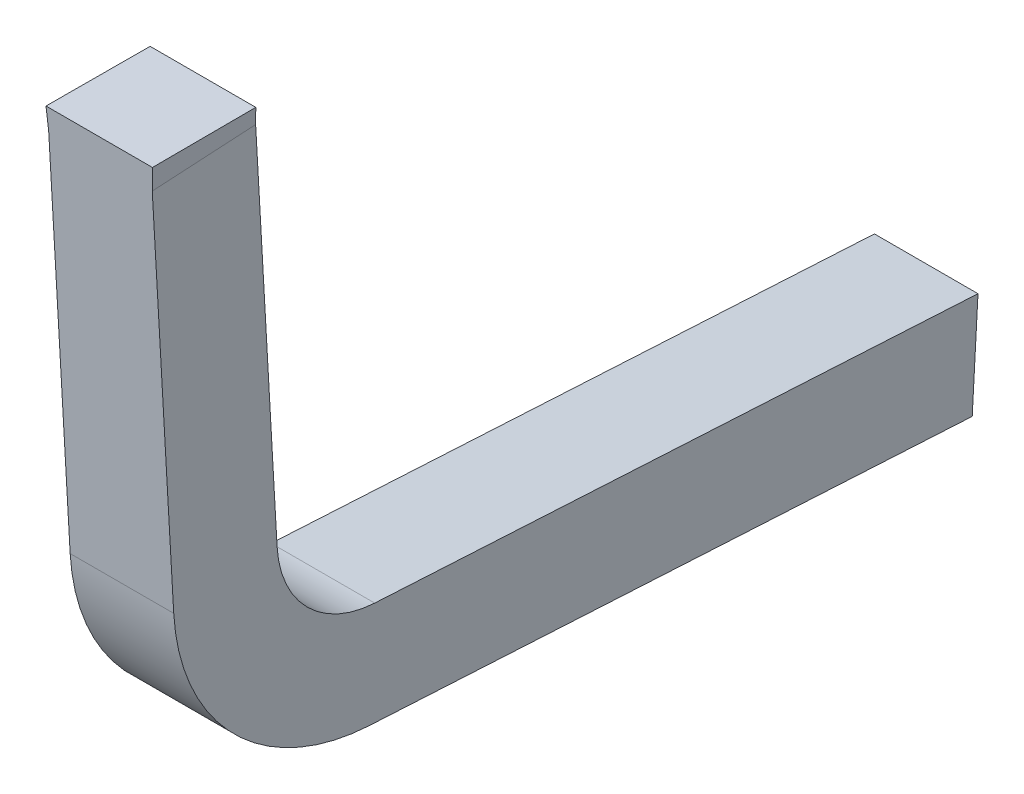
ISO-10303-21;
HEADER;
FILE_DESCRIPTION(('STEP AP214'),'2;1');
FILE_NAME('part.step','',(''),(''),'','','');
FILE_SCHEMA(('AUTOMOTIVE_DESIGN { 1 0 10303 214 1 1 1 1 }'));
ENDSEC;
DATA;
#1=APPLICATION_CONTEXT('core data for automotive mechanical design processes');
#2=APPLICATION_PROTOCOL_DEFINITION('international standard','automotive_design',2000,#1);
#3=PRODUCT_CONTEXT('',#1,'mechanical');
#4=PRODUCT('Part','Part','',(#3));
#5=PRODUCT_RELATED_PRODUCT_CATEGORY('part','',(#4));
#6=PRODUCT_DEFINITION_FORMATION('','',#4);
#7=PRODUCT_DEFINITION_CONTEXT('part definition',#1,'design');
#8=PRODUCT_DEFINITION('design','',#6,#7);
#9=PRODUCT_DEFINITION_SHAPE('','',#8);
#10=(LENGTH_UNIT() NAMED_UNIT(*) SI_UNIT(.MILLI.,.METRE.));
#11=(NAMED_UNIT(*) PLANE_ANGLE_UNIT() SI_UNIT($,.RADIAN.));
#12=(NAMED_UNIT(*) SI_UNIT($,.STERADIAN.) SOLID_ANGLE_UNIT());
#13=UNCERTAINTY_MEASURE_WITH_UNIT(LENGTH_MEASURE(1.E-05),#10,'distance_accuracy_value','');
#14=(GEOMETRIC_REPRESENTATION_CONTEXT(3) GLOBAL_UNCERTAINTY_ASSIGNED_CONTEXT((#13)) GLOBAL_UNIT_ASSIGNED_CONTEXT((#10,
#11,#12)) REPRESENTATION_CONTEXT('',''));
#15=CARTESIAN_POINT('',(0.,0.,0.));
#16=DIRECTION('',(0.,0.,1.));
#17=DIRECTION('',(1.,0.,0.));
#18=AXIS2_PLACEMENT_3D('',#15,#16,#17);
#19=CARTESIAN_POINT('',(3.398593165818,-2.29897527843,-10.34781984343));
#20=DIRECTION('',(0.997785157857701,0.0664110878974701,0.003787632922693));
#21=DIRECTION('',(-0.0664115642747469,0.997792315129046,0.));
#22=AXIS2_PLACEMENT_3D('',#19,#20,#21);
#23=PLANE('',#22);
#24=DIRECTION('',(0.,-0.0569406083110753,0.998377567418842));
#25=VECTOR('',#24,1.);
#26=CARTESIAN_POINT('',(3.4,-2.314349492935,-10.44885919008));
#27=LINE('',#26,#25);
#28=CARTESIAN_POINT('',(3.4,-2.31434949293492,-10.4488591900814));
#29=VERTEX_POINT('',#28);
#30=CARTESIAN_POINT('',(3.4,-2.32573761459728,-10.2491836765951));
#31=VERTEX_POINT('',#30);
#32=EDGE_CURVE('E98',#29,#31,#27,.T.);
#33=ORIENTED_EDGE('',*,*,#32,.T.);
#34=DIRECTION('',(0.0665190105147783,-0.996166318707982,-0.056814493854309));
#35=VECTOR('',#34,1.);
#36=CARTESIAN_POINT('',(3.397186331635,-2.28360106392498,-10.2467804967704));
#37=LINE('',#36,#35);
#38=CARTESIAN_POINT('',(3.397186331635,-2.28360106392499,-10.2467804967704));
#39=VERTEX_POINT('',#38);
#40=EDGE_CURVE('E148',#39,#31,#37,.T.);
#41=ORIENTED_EDGE('',*,*,#40,.F.);
#42=DIRECTION('',(-0.00379601320157547,0.,0.999992795115932));
#43=VECTOR('',#42,1.);
#44=CARTESIAN_POINT('',(3.397946773511,-2.283601063925,-10.4471055106));
#45=LINE('',#44,#43);
#46=CARTESIAN_POINT('',(3.397946773511,-2.28360106392489,-10.4471055106019));
#47=VERTEX_POINT('',#46);
#48=EDGE_CURVE('E161',#47,#39,#45,.T.);
#49=ORIENTED_EDGE('',*,*,#48,.F.);
#50=DIRECTION('',(0.0665190105273673,-0.996166318707226,-0.0568144938528306));
#51=VECTOR('',#50,1.);
#52=CARTESIAN_POINT('',(3.397946773511,-2.28360106392483,-10.4471055106029));
#53=LINE('',#52,#51);
#54=EDGE_CURVE('E103',#47,#29,#53,.T.);
#55=ORIENTED_EDGE('',*,*,#54,.T.);
#56=EDGE_LOOP('',(#33,#41,#49,#55));
#57=FACE_BOUND('',#56,.T.);
#58=ADVANCED_FACE('F17',(#57),#23,.F.);
#59=CARTESIAN_POINT('',(3.5,-2.283601063925,-10.34694300369));
#60=DIRECTION('',(0.,1.,0.));
#61=DIRECTION('',(0.,0.,1.));
#62=AXIS2_PLACEMENT_3D('',#59,#60,#61);
#63=PLANE('',#62);
#64=DIRECTION('',(1.,0.,0.));
#65=VECTOR('',#64,1.);
#66=CARTESIAN_POINT('',(3.5,-2.28360106392498,-10.2467804967704));
#67=LINE('',#66,#65);
#68=CARTESIAN_POINT('',(3.60281366836524,-2.283601063925,-10.2467804967704));
#69=VERTEX_POINT('',#68);
#70=EDGE_CURVE('E154',#69,#39,#67,.F.);
#71=ORIENTED_EDGE('',*,*,#70,.F.);
#72=DIRECTION('',(0.0037960132042621,-1.7968426456006E-13,0.999992795115921));
#73=VECTOR('',#72,1.);
#74=CARTESIAN_POINT('',(3.6020532264892,-2.28360106392501,-10.4471055106));
#75=LINE('',#74,#73);
#76=CARTESIAN_POINT('',(3.60205322648913,-2.28360106392495,-10.447105510601));
#77=VERTEX_POINT('',#76);
#78=EDGE_CURVE('E119',#77,#69,#75,.T.);
#79=ORIENTED_EDGE('',*,*,#78,.F.);
#80=DIRECTION('',(1.,0.,0.));
#81=VECTOR('',#80,1.);
#82=CARTESIAN_POINT('',(3.5,-2.28360106392483,-10.4471055106029));
#83=LINE('',#82,#81);
#84=EDGE_CURVE('E125',#77,#47,#83,.F.);
#85=ORIENTED_EDGE('',*,*,#84,.T.);
#86=ORIENTED_EDGE('',*,*,#48,.T.);
#87=EDGE_LOOP('',(#71,#79,#85,#86));
#88=FACE_BOUND('',#87,.T.);
#89=ADVANCED_FACE('F243',(#88),#63,.T.);
#90=CARTESIAN_POINT('',(3.4,-2.909472777839,-11.05227927458));
#91=DIRECTION('',(1.,0.,0.));
#92=DIRECTION('',(0.,0.,-1.));
#93=AXIS2_PLACEMENT_3D('',#90,#91,#92);
#94=PLANE('',#93);
#95=CARTESIAN_POINT('',(3.4,-3.03,-10.69));
#96=DIRECTION('',(-1.,0.,0.));
#97=DIRECTION('',(0.,0.,1.));
#98=AXIS2_PLACEMENT_3D('',#95,#96,#97);
#99=CIRCLE('',#98,0.4);
#100=CARTESIAN_POINT('',(3.4,-3.05277624331319,-10.2906489730306));
#101=VERTEX_POINT('',#100);
#102=CARTESIAN_POINT('',(3.4,-3.42937693582933,-10.6676826720305));
#103=VERTEX_POINT('',#102);
#104=EDGE_CURVE('E142',#101,#103,#99,.F.);
#105=ORIENTED_EDGE('',*,*,#104,.F.);
#106=DIRECTION('',(0.,-0.998377567418718,-0.056940608313261));
#107=VECTOR('',#106,1.);
#108=CARTESIAN_POINT('',(3.4,-2.668188653621,-10.2687147349));
#109=LINE('',#108,#107);
#110=EDGE_CURVE('E145',#31,#101,#109,.T.);
#111=ORIENTED_EDGE('',*,*,#110,.F.);
#112=ORIENTED_EDGE('',*,*,#32,.F.);
#113=DIRECTION('',(0.,-0.998377567418801,-0.0569406083117901));
#114=VECTOR('',#113,1.);
#115=CARTESIAN_POINT('',(3.4,-2.662494592804,-10.46871499856));
#116=LINE('',#115,#114);
#117=CARTESIAN_POINT('',(3.4,-3.04138812167726,-10.4903244865168));
#118=VERTEX_POINT('',#117);
#119=EDGE_CURVE('E92',#29,#118,#116,.T.);
#120=ORIENTED_EDGE('',*,*,#119,.T.);
#121=CARTESIAN_POINT('',(3.4,-3.03,-10.69));
#122=DIRECTION('',(-1.,0.,0.));
#123=DIRECTION('',(0.,0.,1.));
#124=AXIS2_PLACEMENT_3D('',#121,#122,#123);
#125=CIRCLE('',#124,0.2);
#126=CARTESIAN_POINT('',(3.4,-3.22968846791482,-10.6788413360177));
#127=VERTEX_POINT('',#126);
#128=EDGE_CURVE('E20',#118,#127,#125,.F.);
#129=ORIENTED_EDGE('',*,*,#128,.T.);
#130=DIRECTION('',(0.,0.0557933199228295,0.998442339572991));
#131=VECTOR('',#130,1.);
#132=CARTESIAN_POINT('',(3.4,-3.262244863925,-11.26145022621));
#133=LINE('',#132,#131);
#134=CARTESIAN_POINT('',(3.4,-3.29480125993501,-11.8440591164004));
#135=VERTEX_POINT('',#134);
#136=EDGE_CURVE('E111',#135,#127,#133,.T.);
#137=ORIENTED_EDGE('',*,*,#136,.F.);
#138=DIRECTION('',(0.,-0.998442339574031,0.0557933199042218));
#139=VECTOR('',#138,1.);
#140=CARTESIAN_POINT('',(3.4,-3.394645493892,-11.83847978441));
#141=LINE('',#140,#139);
#142=CARTESIAN_POINT('',(3.4,-3.49448972784906,-11.8329004524196));
#143=VERTEX_POINT('',#142);
#144=EDGE_CURVE('E135',#135,#143,#141,.T.);
#145=ORIENTED_EDGE('',*,*,#144,.T.);
#146=DIRECTION('',(0.,0.055793319922371,0.998442339573017));
#147=VECTOR('',#146,1.);
#148=CARTESIAN_POINT('',(3.4,-3.461933331839,-11.25029156222));
#149=LINE('',#148,#147);
#150=EDGE_CURVE('E140',#143,#103,#149,.T.);
#151=ORIENTED_EDGE('',*,*,#150,.T.);
#152=EDGE_LOOP('',(#105,#111,#112,#120,#129,#137,#145,#151));
#153=FACE_BOUND('',#152,.T.);
#154=ADVANCED_FACE('F95',(#153),#94,.F.);
#155=CARTESIAN_POINT('',(3.5,-3.262244863925,-11.26145022621));
#156=DIRECTION('',(0.,0.998442339572991,-0.0557933199228295));
#157=DIRECTION('',(0.,0.0557933199228295,0.998442339572991));
#158=AXIS2_PLACEMENT_3D('',#155,#156,#157);
#159=PLANE('',#158);
#160=DIRECTION('',(0.,0.055793319922887,0.998442339572988));
#161=VECTOR('',#160,1.);
#162=CARTESIAN_POINT('',(3.6,-3.294801259935,-11.8440591164));
#163=LINE('',#162,#161);
#164=CARTESIAN_POINT('',(3.6,-3.29480125993501,-11.8440591164001));
#165=VERTEX_POINT('',#164);
#166=CARTESIAN_POINT('',(3.6,-3.2296884679148,-10.6788413360177));
#167=VERTEX_POINT('',#166);
#168=EDGE_CURVE('E129',#165,#167,#163,.T.);
#169=ORIENTED_EDGE('',*,*,#168,.F.);
#170=DIRECTION('',(1.,0.,0.));
#171=VECTOR('',#170,1.);
#172=CARTESIAN_POINT('',(3.5,-3.29480125993502,-11.8440591164004));
#173=LINE('',#172,#171);
#174=EDGE_CURVE('E126',#165,#135,#173,.F.);
#175=ORIENTED_EDGE('',*,*,#174,.T.);
#176=ORIENTED_EDGE('',*,*,#136,.T.);
#177=DIRECTION('',(-1.,0.,0.));
#178=VECTOR('',#177,1.);
#179=CARTESIAN_POINT('',(3.604,-3.22968846791485,-10.67884133602));
#180=LINE('',#179,#178);
#181=EDGE_CURVE('E110',#127,#167,#180,.F.);
#182=ORIENTED_EDGE('',*,*,#181,.T.);
#183=EDGE_LOOP('',(#169,#175,#176,#182));
#184=FACE_BOUND('',#183,.T.);
#185=ADVANCED_FACE('F234',(#184),#159,.T.);
#186=CARTESIAN_POINT('',(3.604,-3.03,-10.69));
#187=DIRECTION('',(-1.,0.,0.));
#188=DIRECTION('',(0.,0.,1.));
#189=AXIS2_PLACEMENT_3D('',#186,#187,#188);
#190=CYLINDRICAL_SURFACE('',#189,0.2);
#191=ORIENTED_EDGE('',*,*,#128,.F.);
#192=DIRECTION('',(1.,0.,0.));
#193=VECTOR('',#192,1.);
#194=CARTESIAN_POINT('',(3.5,-3.04138812169214,-10.4903244865176));
#195=LINE('',#194,#193);
#196=CARTESIAN_POINT('',(3.6,-3.04138812167779,-10.490324486518));
#197=VERTEX_POINT('',#196);
#198=EDGE_CURVE('E102',#118,#197,#195,.T.);
#199=ORIENTED_EDGE('',*,*,#198,.T.);
#200=CARTESIAN_POINT('',(3.6,-3.03,-10.69));
#201=DIRECTION('',(-1.,0.,0.));
#202=DIRECTION('',(0.,0.,1.));
#203=AXIS2_PLACEMENT_3D('',#200,#201,#202);
#204=CIRCLE('',#203,0.2);
#205=EDGE_CURVE('E185',#167,#197,#204,.T.);
#206=ORIENTED_EDGE('',*,*,#205,.F.);
#207=ORIENTED_EDGE('',*,*,#181,.F.);
#208=EDGE_LOOP('',(#191,#199,#206,#207));
#209=FACE_BOUND('',#208,.T.);
#210=ADVANCED_FACE('F107',(#209),#190,.F.);
#211=CARTESIAN_POINT('',(3.5,-2.662494592804,-10.46871499856));
#212=DIRECTION('',(0.,-0.0569406083117901,0.998377567418801));
#213=DIRECTION('',(0.,-0.998377567418801,-0.0569406083117901));
#214=AXIS2_PLACEMENT_3D('',#211,#212,#213);
#215=PLANE('',#214);
#216=DIRECTION('',(0.,0.998377567418456,0.0569406083178453));
#217=VECTOR('',#216,1.);
#218=CARTESIAN_POINT('',(3.6,-3.041388121692,-10.49032448652));
#219=LINE('',#218,#217);
#220=CARTESIAN_POINT('',(3.60000000000008,-2.314349492934,-10.44885919008));
#221=VERTEX_POINT('',#220);
#222=EDGE_CURVE('E114',#197,#221,#219,.T.);
#223=ORIENTED_EDGE('',*,*,#222,.F.);
#224=ORIENTED_EDGE('',*,*,#198,.F.);
#225=ORIENTED_EDGE('',*,*,#119,.F.);
#226=ORIENTED_EDGE('',*,*,#54,.F.);
#227=ORIENTED_EDGE('',*,*,#84,.F.);
#228=DIRECTION('',(0.0665190105284185,0.996166318705548,0.0568144938810224));
#229=VECTOR('',#228,1.);
#230=CARTESIAN_POINT('',(3.60000000000023,-2.31434949293401,-10.44885919008));
#231=LINE('',#230,#229);
#232=EDGE_CURVE('E116',#221,#77,#231,.T.);
#233=ORIENTED_EDGE('',*,*,#232,.F.);
#234=EDGE_LOOP('',(#223,#224,#225,#226,#227,#233));
#235=FACE_BOUND('',#234,.T.);
#236=ADVANCED_FACE('F112',(#235),#215,.F.);
#237=CARTESIAN_POINT('',(3.601406834183,-2.298975278429,-10.34781984343));
#238=DIRECTION('',(0.9977851578563,-0.06641108791847,-0.003787632923708));
#239=DIRECTION('',(0.0664115642957472,0.997792315127648,0.));
#240=AXIS2_PLACEMENT_3D('',#237,#238,#239);
#241=PLANE('',#240);
#242=ORIENTED_EDGE('',*,*,#232,.T.);
#243=ORIENTED_EDGE('',*,*,#78,.T.);
#244=DIRECTION('',(0.0665190105179116,0.996166318707773,0.0568144938543194));
#245=VECTOR('',#244,1.);
#246=CARTESIAN_POINT('',(3.6,-2.32573761459528,-10.249183676595));
#247=LINE('',#246,#245);
#248=CARTESIAN_POINT('',(3.6,-2.32573761459509,-10.2491836765983));
#249=VERTEX_POINT('',#248);
#250=EDGE_CURVE('E147',#249,#69,#247,.T.);
#251=ORIENTED_EDGE('',*,*,#250,.F.);
#252=DIRECTION('',(0.,-0.0569406083060912,0.998377567419126));
#253=VECTOR('',#252,1.);
#254=CARTESIAN_POINT('',(3.6,-2.314349492934,-10.44885919008));
#255=LINE('',#254,#253);
#256=EDGE_CURVE('E200',#221,#249,#255,.T.);
#257=ORIENTED_EDGE('',*,*,#256,.F.);
#258=EDGE_LOOP('',(#242,#243,#251,#257));
#259=FACE_BOUND('',#258,.T.);
#260=ADVANCED_FACE('F258',(#259),#241,.T.);
#261=CARTESIAN_POINT('',(3.5,-2.668188653621,-10.2687147349));
#262=DIRECTION('',(0.,-0.056940608313261,0.998377567418718));
#263=DIRECTION('',(0.,-0.998377567418718,-0.056940608313261));
#264=AXIS2_PLACEMENT_3D('',#261,#262,#263);
#265=PLANE('',#264);
#266=ORIENTED_EDGE('',*,*,#250,.T.);
#267=ORIENTED_EDGE('',*,*,#70,.T.);
#268=ORIENTED_EDGE('',*,*,#40,.T.);
#269=ORIENTED_EDGE('',*,*,#110,.T.);
#270=DIRECTION('',(-1.,0.,0.));
#271=VECTOR('',#270,1.);
#272=CARTESIAN_POINT('',(3.604,-3.05277624330094,-10.2906489730311));
#273=LINE('',#272,#271);
#274=CARTESIAN_POINT('',(3.6,-3.05277624331214,-10.2906489730312));
#275=VERTEX_POINT('',#274);
#276=EDGE_CURVE('E157',#275,#101,#273,.T.);
#277=ORIENTED_EDGE('',*,*,#276,.F.);
#278=DIRECTION('',(0.,-0.998377567419005,-0.0569406083082185));
#279=VECTOR('',#278,1.);
#280=CARTESIAN_POINT('',(3.6,-2.325737614595,-10.2491836766));
#281=LINE('',#280,#279);
#282=EDGE_CURVE('E184',#249,#275,#281,.T.);
#283=ORIENTED_EDGE('',*,*,#282,.F.);
#284=EDGE_LOOP('',(#266,#267,#268,#269,#277,#283));
#285=FACE_BOUND('',#284,.T.);
#286=ADVANCED_FACE('F227',(#285),#265,.T.);
#287=CARTESIAN_POINT('',(3.604,-3.03,-10.69));
#288=DIRECTION('',(-1.,0.,0.));
#289=DIRECTION('',(0.,0.,1.));
#290=AXIS2_PLACEMENT_3D('',#287,#288,#289);
#291=CYLINDRICAL_SURFACE('',#290,0.4);
#292=DIRECTION('',(1.,0.,0.));
#293=VECTOR('',#292,1.);
#294=CARTESIAN_POINT('',(3.5,-3.4293769358293,-10.66768267203));
#295=LINE('',#294,#293);
#296=CARTESIAN_POINT('',(3.6,-3.42937693582946,-10.6676826720306));
#297=VERTEX_POINT('',#296);
#298=EDGE_CURVE('E137',#103,#297,#295,.T.);
#299=ORIENTED_EDGE('',*,*,#298,.T.);
#300=CARTESIAN_POINT('',(3.6,-3.03,-10.69));
#301=DIRECTION('',(-1.,0.,0.));
#302=DIRECTION('',(0.,0.,1.));
#303=AXIS2_PLACEMENT_3D('',#300,#301,#302);
#304=CIRCLE('',#303,0.4);
#305=EDGE_CURVE('E181',#275,#297,#304,.F.);
#306=ORIENTED_EDGE('',*,*,#305,.F.);
#307=ORIENTED_EDGE('',*,*,#276,.T.);
#308=ORIENTED_EDGE('',*,*,#104,.T.);
#309=EDGE_LOOP('',(#299,#306,#307,#308));
#310=FACE_BOUND('',#309,.T.);
#311=ADVANCED_FACE('F220',(#310),#291,.T.);
#312=CARTESIAN_POINT('',(3.5,-3.461933331839,-11.25029156222));
#313=DIRECTION('',(0.,0.998442339573017,-0.055793319922371));
#314=DIRECTION('',(0.,0.055793319922371,0.998442339573017));
#315=AXIS2_PLACEMENT_3D('',#312,#313,#314);
#316=PLANE('',#315);
#317=ORIENTED_EDGE('',*,*,#298,.F.);
#318=ORIENTED_EDGE('',*,*,#150,.F.);
#319=DIRECTION('',(1.,0.,0.));
#320=VECTOR('',#319,1.);
#321=CARTESIAN_POINT('',(3.5,-3.49448972784898,-11.8329004524196));
#322=LINE('',#321,#320);
#323=CARTESIAN_POINT('',(3.6,-3.49448972784899,-11.8329004524199));
#324=VERTEX_POINT('',#323);
#325=EDGE_CURVE('E35',#143,#324,#322,.T.);
#326=ORIENTED_EDGE('',*,*,#325,.T.);
#327=DIRECTION('',(0.,-0.0557933199219327,-0.998442339573042));
#328=VECTOR('',#327,1.);
#329=CARTESIAN_POINT('',(3.6,-3.429376935829,-10.66768267202));
#330=LINE('',#329,#328);
#331=EDGE_CURVE('E26',#297,#324,#330,.T.);
#332=ORIENTED_EDGE('',*,*,#331,.F.);
#333=EDGE_LOOP('',(#317,#318,#326,#332));
#334=FACE_BOUND('',#333,.T.);
#335=ADVANCED_FACE('F222',(#334),#316,.F.);
#336=CARTESIAN_POINT('',(3.5,-3.394645493892,-11.83847978441));
#337=DIRECTION('',(0.,0.0557933199042218,0.998442339574031));
#338=DIRECTION('',(0.,-0.998442339574031,0.0557933199042218));
#339=AXIS2_PLACEMENT_3D('',#336,#337,#338);
#340=PLANE('',#339);
#341=DIRECTION('',(0.,0.998442339574254,-0.0557933199002383));
#342=VECTOR('',#341,1.);
#343=CARTESIAN_POINT('',(3.6,-3.494489727849,-11.83290045242));
#344=LINE('',#343,#342);
#345=EDGE_CURVE('E11',#324,#165,#344,.T.);
#346=ORIENTED_EDGE('',*,*,#345,.F.);
#347=ORIENTED_EDGE('',*,*,#325,.F.);
#348=ORIENTED_EDGE('',*,*,#144,.F.);
#349=ORIENTED_EDGE('',*,*,#174,.F.);
#350=EDGE_LOOP('',(#346,#347,#348,#349));
#351=FACE_BOUND('',#350,.T.);
#352=ADVANCED_FACE('F230',(#351),#340,.F.);
#353=CARTESIAN_POINT('',(3.6,-2.909472777838,-11.05227927458));
#354=DIRECTION('',(1.,0.,0.));
#355=DIRECTION('',(0.,0.,-1.));
#356=AXIS2_PLACEMENT_3D('',#353,#354,#355);
#357=PLANE('',#356);
#358=ORIENTED_EDGE('',*,*,#331,.T.);
#359=ORIENTED_EDGE('',*,*,#345,.T.);
#360=ORIENTED_EDGE('',*,*,#168,.T.);
#361=ORIENTED_EDGE('',*,*,#205,.T.);
#362=ORIENTED_EDGE('',*,*,#222,.T.);
#363=ORIENTED_EDGE('',*,*,#256,.T.);
#364=ORIENTED_EDGE('',*,*,#282,.T.);
#365=ORIENTED_EDGE('',*,*,#305,.T.);
#366=EDGE_LOOP('',(#358,#359,#360,#361,#362,#363,#364,#365));
#367=FACE_BOUND('',#366,.T.);
#368=ADVANCED_FACE('F224',(#367),#357,.T.);
#369=CLOSED_SHELL('',(#58,#89,#154,#185,#210,#236,#260,#286,#311,#335,#352,#368));
#370=MANIFOLD_SOLID_BREP('B1',#369);
#371=ADVANCED_BREP_SHAPE_REPRESENTATION('',(#18,#370),#14);
#372=SHAPE_DEFINITION_REPRESENTATION(#9,#371);
ENDSEC;
END-ISO-10303-21;
